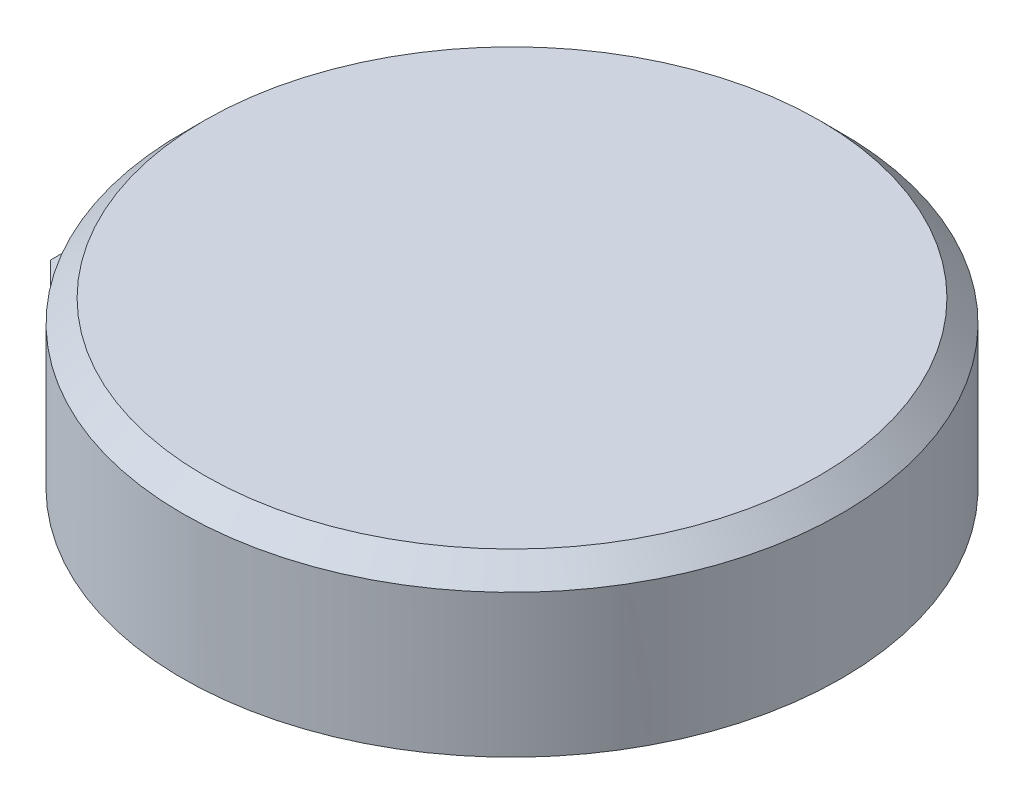
ISO-10303-21;
HEADER;
FILE_DESCRIPTION(('STEP AP214'),'2;1');
FILE_NAME('part.step','',(''),(''),'','','');
FILE_SCHEMA(('AUTOMOTIVE_DESIGN { 1 0 10303 214 1 1 1 1 }'));
ENDSEC;
DATA;
#1=APPLICATION_CONTEXT('core data for automotive mechanical design processes');
#2=APPLICATION_PROTOCOL_DEFINITION('international standard','automotive_design',2000,#1);
#3=PRODUCT_CONTEXT('',#1,'mechanical');
#4=PRODUCT('Part','Part','',(#3));
#5=PRODUCT_RELATED_PRODUCT_CATEGORY('part','',(#4));
#6=PRODUCT_DEFINITION_FORMATION('','',#4);
#7=PRODUCT_DEFINITION_CONTEXT('part definition',#1,'design');
#8=PRODUCT_DEFINITION('design','',#6,#7);
#9=PRODUCT_DEFINITION_SHAPE('','',#8);
#10=(LENGTH_UNIT() NAMED_UNIT(*) SI_UNIT(.MILLI.,.METRE.));
#11=(NAMED_UNIT(*) PLANE_ANGLE_UNIT() SI_UNIT($,.RADIAN.));
#12=(NAMED_UNIT(*) SI_UNIT($,.STERADIAN.) SOLID_ANGLE_UNIT());
#13=UNCERTAINTY_MEASURE_WITH_UNIT(LENGTH_MEASURE(1.E-05),#10,'distance_accuracy_value','');
#14=(GEOMETRIC_REPRESENTATION_CONTEXT(3) GLOBAL_UNCERTAINTY_ASSIGNED_CONTEXT((#13)) GLOBAL_UNIT_ASSIGNED_CONTEXT((#10,
#11,#12)) REPRESENTATION_CONTEXT('',''));
#15=CARTESIAN_POINT('',(0.,0.,0.));
#16=DIRECTION('',(0.,0.,1.));
#17=DIRECTION('',(1.,0.,0.));
#18=AXIS2_PLACEMENT_3D('',#15,#16,#17);
#19=CARTESIAN_POINT('',(0.,75.,0.));
#20=DIRECTION('',(0.,-1.,0.));
#21=DIRECTION('',(0.,0.,-1.));
#22=AXIS2_PLACEMENT_3D('',#19,#20,#21);
#23=CYLINDRICAL_SURFACE('',#22,150.);
#24=CARTESIAN_POINT('',(0.,64.9999999999999,0.));
#25=DIRECTION('',(0.,1.,0.));
#26=DIRECTION('',(0.,0.,1.));
#27=AXIS2_PLACEMENT_3D('',#24,#25,#26);
#28=CIRCLE('',#27,150.);
#29=CARTESIAN_POINT('',(0.,64.9999999999999,150.));
#30=VERTEX_POINT('',#29);
#31=EDGE_CURVE('E124',#30,#30,#28,.F.);
#32=ORIENTED_EDGE('',*,*,#31,.T.);
#33=EDGE_LOOP('',(#32));
#34=FACE_BOUND('',#33,.T.);
#35=CARTESIAN_POINT('',(0.,9.99999999999999,0.));
#36=DIRECTION('',(0.,-1.,0.));
#37=DIRECTION('',(0.,0.,-1.));
#38=AXIS2_PLACEMENT_3D('',#35,#36,#37);
#39=CIRCLE('',#38,150.);
#40=CARTESIAN_POINT('',(-145.859521458148,9.99999999999999,35.));
#41=VERTEX_POINT('',#40);
#42=CARTESIAN_POINT('',(-145.859521458148,9.99999999999999,-35.));
#43=VERTEX_POINT('',#42);
#44=EDGE_CURVE('E106',#41,#43,#39,.T.);
#45=ORIENTED_EDGE('',*,*,#44,.F.);
#46=DIRECTION('',(0.,-1.,0.));
#47=VECTOR('',#46,1.);
#48=CARTESIAN_POINT('',(-145.859521458148,75.,35.));
#49=LINE('',#48,#47);
#50=CARTESIAN_POINT('',(-145.859521458148,0.,35.));
#51=VERTEX_POINT('',#50);
#52=EDGE_CURVE('E116',#41,#51,#49,.T.);
#53=ORIENTED_EDGE('',*,*,#52,.T.);
#54=CARTESIAN_POINT('',(0.,0.,0.));
#55=DIRECTION('',(0.,1.,0.));
#56=DIRECTION('',(0.,0.,1.));
#57=AXIS2_PLACEMENT_3D('',#54,#55,#56);
#58=CIRCLE('',#57,150.);
#59=CARTESIAN_POINT('',(-145.859521458148,0.,-35.));
#60=VERTEX_POINT('',#59);
#61=EDGE_CURVE('E119',#51,#60,#58,.T.);
#62=ORIENTED_EDGE('',*,*,#61,.T.);
#63=DIRECTION('',(0.,-1.,0.));
#64=VECTOR('',#63,1.);
#65=CARTESIAN_POINT('',(-145.859521458148,75.,-35.));
#66=LINE('',#65,#64);
#67=EDGE_CURVE('E100',#60,#43,#66,.F.);
#68=ORIENTED_EDGE('',*,*,#67,.T.);
#69=EDGE_LOOP('',(#45,#53,#62,#68));
#70=FACE_BOUND('',#69,.T.);
#71=ADVANCED_FACE('F39',(#34,#70),#23,.T.);
#72=CARTESIAN_POINT('',(0.,75.,0.));
#73=DIRECTION('',(0.,1.,0.));
#74=DIRECTION('',(0.,0.,1.));
#75=AXIS2_PLACEMENT_3D('',#72,#73,#74);
#76=PLANE('',#75);
#77=CARTESIAN_POINT('',(0.,75.,0.));
#78=DIRECTION('',(0.,1.,0.));
#79=DIRECTION('',(0.,0.,1.));
#80=AXIS2_PLACEMENT_3D('',#77,#78,#79);
#81=CIRCLE('',#80,140.);
#82=CARTESIAN_POINT('',(0.,75.,140.));
#83=VERTEX_POINT('',#82);
#84=EDGE_CURVE('E121',#83,#83,#81,.T.);
#85=ORIENTED_EDGE('',*,*,#84,.T.);
#86=EDGE_LOOP('',(#85));
#87=FACE_BOUND('',#86,.T.);
#88=ADVANCED_FACE('F145',(#87),#76,.T.);
#89=CARTESIAN_POINT('',(0.,0.,0.));
#90=DIRECTION('',(0.,1.,0.));
#91=DIRECTION('',(0.,0.,1.));
#92=AXIS2_PLACEMENT_3D('',#89,#90,#91);
#93=PLANE('',#92);
#94=DIRECTION('',(-1.,0.,0.));
#95=VECTOR('',#94,1.);
#96=CARTESIAN_POINT('',(-115.,0.,35.));
#97=LINE('',#96,#95);
#98=CARTESIAN_POINT('',(-175.,0.,35.));
#99=VERTEX_POINT('',#98);
#100=EDGE_CURVE('E92',#51,#99,#97,.T.);
#101=ORIENTED_EDGE('',*,*,#100,.T.);
#102=DIRECTION('',(0.707106781186548,0.,0.707106781186548));
#103=VECTOR('',#102,1.);
#104=CARTESIAN_POINT('',(-175.,0.,35.));
#105=LINE('',#104,#103);
#106=CARTESIAN_POINT('',(-185.,0.,25.0000000000001));
#107=VERTEX_POINT('',#106);
#108=EDGE_CURVE('E62',#99,#107,#105,.F.);
#109=ORIENTED_EDGE('',*,*,#108,.T.);
#110=DIRECTION('',(0.,0.,-1.));
#111=VECTOR('',#110,1.);
#112=CARTESIAN_POINT('',(-185.,0.,-35.));
#113=LINE('',#112,#111);
#114=CARTESIAN_POINT('',(-185.,0.,-35.));
#115=VERTEX_POINT('',#114);
#116=EDGE_CURVE('E111',#107,#115,#113,.T.);
#117=ORIENTED_EDGE('',*,*,#116,.T.);
#118=DIRECTION('',(1.,0.,0.));
#119=VECTOR('',#118,1.);
#120=CARTESIAN_POINT('',(-115.,0.,-35.));
#121=LINE('',#120,#119);
#122=EDGE_CURVE('E99',#115,#60,#121,.T.);
#123=ORIENTED_EDGE('',*,*,#122,.T.);
#124=ORIENTED_EDGE('',*,*,#61,.F.);
#125=EDGE_LOOP('',(#101,#109,#117,#123,#124));
#126=FACE_BOUND('',#125,.T.);
#127=ADVANCED_FACE('F137',(#126),#93,.F.);
#128=CARTESIAN_POINT('',(0.,75.,0.));
#129=DIRECTION('',(0.,-1.,0.));
#130=DIRECTION('',(0.,0.,-1.));
#131=AXIS2_PLACEMENT_3D('',#128,#129,#130);
#132=CONICAL_SURFACE('',#131,140.,0.785398163397446);
#133=ORIENTED_EDGE('',*,*,#31,.F.);
#134=EDGE_LOOP('',(#133));
#135=FACE_BOUND('',#134,.T.);
#136=ORIENTED_EDGE('',*,*,#84,.F.);
#137=EDGE_LOOP('',(#136));
#138=FACE_BOUND('',#137,.T.);
#139=ADVANCED_FACE('F155',(#135,#138),#132,.T.);
#140=CARTESIAN_POINT('',(-115.,10.,35.));
#141=DIRECTION('',(0.,0.,1.));
#142=DIRECTION('',(1.,0.,0.));
#143=AXIS2_PLACEMENT_3D('',#140,#141,#142);
#144=PLANE('',#143);
#145=DIRECTION('',(-1.,0.,0.));
#146=VECTOR('',#145,1.);
#147=CARTESIAN_POINT('',(-115.,10.,35.));
#148=LINE('',#147,#146);
#149=CARTESIAN_POINT('',(-175.,10.,35.));
#150=VERTEX_POINT('',#149);
#151=EDGE_CURVE('E101',#41,#150,#148,.T.);
#152=ORIENTED_EDGE('',*,*,#151,.T.);
#153=DIRECTION('',(0.,-1.,0.));
#154=VECTOR('',#153,1.);
#155=CARTESIAN_POINT('',(-175.,10.,35.));
#156=LINE('',#155,#154);
#157=EDGE_CURVE('E128',#150,#99,#156,.T.);
#158=ORIENTED_EDGE('',*,*,#157,.T.);
#159=ORIENTED_EDGE('',*,*,#100,.F.);
#160=ORIENTED_EDGE('',*,*,#52,.F.);
#161=EDGE_LOOP('',(#152,#158,#159,#160));
#162=FACE_BOUND('',#161,.T.);
#163=ADVANCED_FACE('F134',(#162),#144,.T.);
#164=CARTESIAN_POINT('',(-115.,10.,-35.));
#165=DIRECTION('',(0.,0.,-1.));
#166=DIRECTION('',(-1.,0.,0.));
#167=AXIS2_PLACEMENT_3D('',#164,#165,#166);
#168=PLANE('',#167);
#169=ORIENTED_EDGE('',*,*,#67,.F.);
#170=ORIENTED_EDGE('',*,*,#122,.F.);
#171=DIRECTION('',(0.,-1.,0.));
#172=VECTOR('',#171,1.);
#173=CARTESIAN_POINT('',(-185.,10.,-35.));
#174=LINE('',#173,#172);
#175=CARTESIAN_POINT('',(-185.,10.,-35.));
#176=VERTEX_POINT('',#175);
#177=EDGE_CURVE('E86',#176,#115,#174,.T.);
#178=ORIENTED_EDGE('',*,*,#177,.F.);
#179=DIRECTION('',(1.,0.,0.));
#180=VECTOR('',#179,1.);
#181=CARTESIAN_POINT('',(-115.,10.,-35.));
#182=LINE('',#181,#180);
#183=EDGE_CURVE('E91',#176,#43,#182,.T.);
#184=ORIENTED_EDGE('',*,*,#183,.T.);
#185=EDGE_LOOP('',(#169,#170,#178,#184));
#186=FACE_BOUND('',#185,.T.);
#187=ADVANCED_FACE('F97',(#186),#168,.T.);
#188=CARTESIAN_POINT('',(-185.,10.,-35.));
#189=DIRECTION('',(-1.,0.,0.));
#190=DIRECTION('',(0.,0.,1.));
#191=AXIS2_PLACEMENT_3D('',#188,#189,#190);
#192=PLANE('',#191);
#193=ORIENTED_EDGE('',*,*,#116,.F.);
#194=DIRECTION('',(0.,1.,0.));
#195=VECTOR('',#194,1.);
#196=CARTESIAN_POINT('',(-185.,10.,25.0000000000001));
#197=LINE('',#196,#195);
#198=CARTESIAN_POINT('',(-185.,10.,25.0000000000001));
#199=VERTEX_POINT('',#198);
#200=EDGE_CURVE('E48',#107,#199,#197,.T.);
#201=ORIENTED_EDGE('',*,*,#200,.T.);
#202=DIRECTION('',(0.,0.,-1.));
#203=VECTOR('',#202,1.);
#204=CARTESIAN_POINT('',(-185.,10.,-35.));
#205=LINE('',#204,#203);
#206=EDGE_CURVE('E83',#199,#176,#205,.T.);
#207=ORIENTED_EDGE('',*,*,#206,.T.);
#208=ORIENTED_EDGE('',*,*,#177,.T.);
#209=EDGE_LOOP('',(#193,#201,#207,#208));
#210=FACE_BOUND('',#209,.T.);
#211=ADVANCED_FACE('F85',(#210),#192,.T.);
#212=CARTESIAN_POINT('',(0.,10.,0.));
#213=DIRECTION('',(0.,-1.,0.));
#214=DIRECTION('',(0.,0.,-1.));
#215=AXIS2_PLACEMENT_3D('',#212,#213,#214);
#216=PLANE('',#215);
#217=ORIENTED_EDGE('',*,*,#206,.F.);
#218=DIRECTION('',(-0.707106781186548,0.,-0.707106781186548));
#219=VECTOR('',#218,1.);
#220=CARTESIAN_POINT('',(-175.,10.,35.));
#221=LINE('',#220,#219);
#222=EDGE_CURVE('E11',#199,#150,#221,.F.);
#223=ORIENTED_EDGE('',*,*,#222,.T.);
#224=ORIENTED_EDGE('',*,*,#151,.F.);
#225=ORIENTED_EDGE('',*,*,#44,.T.);
#226=ORIENTED_EDGE('',*,*,#183,.F.);
#227=EDGE_LOOP('',(#217,#223,#224,#225,#226));
#228=FACE_BOUND('',#227,.T.);
#229=ADVANCED_FACE('F104',(#228),#216,.F.);
#230=CARTESIAN_POINT('',(-175.,10.,35.));
#231=DIRECTION('',(0.707106781186547,0.,-0.707106781186547));
#232=DIRECTION('',(0.,-1.,0.));
#233=AXIS2_PLACEMENT_3D('',#230,#231,#232);
#234=PLANE('',#233);
#235=ORIENTED_EDGE('',*,*,#222,.F.);
#236=ORIENTED_EDGE('',*,*,#200,.F.);
#237=ORIENTED_EDGE('',*,*,#108,.F.);
#238=ORIENTED_EDGE('',*,*,#157,.F.);
#239=EDGE_LOOP('',(#235,#236,#237,#238));
#240=FACE_BOUND('',#239,.T.);
#241=ADVANCED_FACE('F42',(#240),#234,.F.);
#242=CLOSED_SHELL('',(#71,#88,#127,#139,#163,#187,#211,#229,#241));
#243=MANIFOLD_SOLID_BREP('B2',#242);
#244=ADVANCED_BREP_SHAPE_REPRESENTATION('',(#18,#243),#14);
#245=SHAPE_DEFINITION_REPRESENTATION(#9,#244);
ENDSEC;
END-ISO-10303-21;
